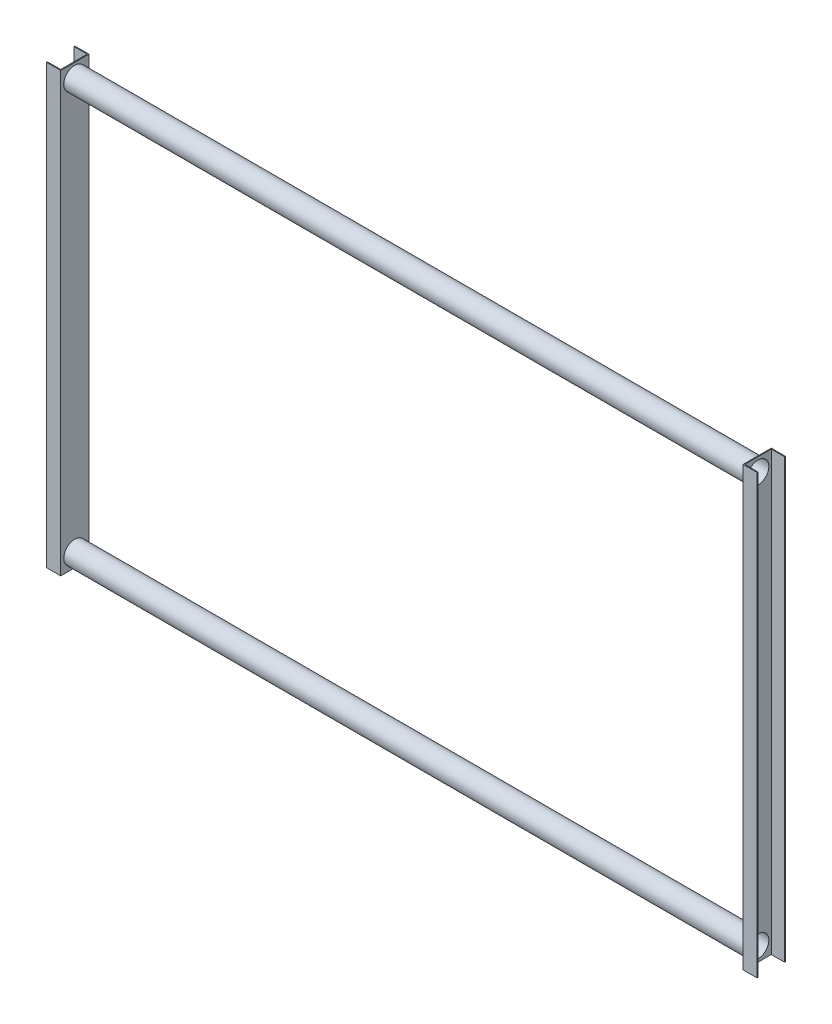
ISO-10303-21;
HEADER;
FILE_DESCRIPTION(('STEP AP214'),'2;1');
FILE_NAME('part.step','',(''),(''),'','','');
FILE_SCHEMA(('AUTOMOTIVE_DESIGN { 1 0 10303 214 1 1 1 1 }'));
ENDSEC;
DATA;
#1=APPLICATION_CONTEXT('core data for automotive mechanical design processes');
#2=APPLICATION_PROTOCOL_DEFINITION('international standard','automotive_design',2000,#1);
#3=PRODUCT_CONTEXT('',#1,'mechanical');
#4=PRODUCT('Part','Part','',(#3));
#5=PRODUCT_RELATED_PRODUCT_CATEGORY('part','',(#4));
#6=PRODUCT_DEFINITION_FORMATION('','',#4);
#7=PRODUCT_DEFINITION_CONTEXT('part definition',#1,'design');
#8=PRODUCT_DEFINITION('design','',#6,#7);
#9=PRODUCT_DEFINITION_SHAPE('','',#8);
#10=(LENGTH_UNIT() NAMED_UNIT(*) SI_UNIT(.MILLI.,.METRE.));
#11=(NAMED_UNIT(*) PLANE_ANGLE_UNIT() SI_UNIT($,.RADIAN.));
#12=(NAMED_UNIT(*) SI_UNIT($,.STERADIAN.) SOLID_ANGLE_UNIT());
#13=UNCERTAINTY_MEASURE_WITH_UNIT(LENGTH_MEASURE(1.E-05),#10,'distance_accuracy_value','');
#14=(GEOMETRIC_REPRESENTATION_CONTEXT(3) GLOBAL_UNCERTAINTY_ASSIGNED_CONTEXT((#13)) GLOBAL_UNIT_ASSIGNED_CONTEXT((#10,
#11,#12)) REPRESENTATION_CONTEXT('',''));
#15=CARTESIAN_POINT('',(0.,0.,0.));
#16=DIRECTION('',(0.,0.,1.));
#17=DIRECTION('',(1.,0.,0.));
#18=AXIS2_PLACEMENT_3D('',#15,#16,#17);
#19=CARTESIAN_POINT('',(0.,1600.,-51.5));
#20=DIRECTION('',(-1.,0.,0.));
#21=DIRECTION('',(0.,0.,1.));
#22=AXIS2_PLACEMENT_3D('',#19,#20,#21);
#23=PLANE('',#22);
#24=CARTESIAN_POINT('',(0.,50.,0.));
#25=DIRECTION('',(-1.,0.,0.));
#26=DIRECTION('',(0.,0.,1.));
#27=AXIS2_PLACEMENT_3D('',#24,#25,#26);
#28=CIRCLE('',#27,40.5);
#29=CARTESIAN_POINT('',(0.,50.,40.5));
#30=VERTEX_POINT('',#29);
#31=EDGE_CURVE('E191',#30,#30,#28,.F.);
#32=ORIENTED_EDGE('',*,*,#31,.F.);
#33=EDGE_LOOP('',(#32));
#34=FACE_BOUND('',#33,.T.);
#35=DIRECTION('',(0.,0.,-1.));
#36=VECTOR('',#35,1.);
#37=CARTESIAN_POINT('',(0.,0.,-51.5));
#38=LINE('',#37,#36);
#39=CARTESIAN_POINT('',(0.,0.,51.5));
#40=VERTEX_POINT('',#39);
#41=CARTESIAN_POINT('',(0.,0.,-51.5));
#42=VERTEX_POINT('',#41);
#43=EDGE_CURVE('E157',#40,#42,#38,.T.);
#44=ORIENTED_EDGE('',*,*,#43,.T.);
#45=DIRECTION('',(0.,-1.,0.));
#46=VECTOR('',#45,1.);
#47=CARTESIAN_POINT('',(0.,1600.,-51.5));
#48=LINE('',#47,#46);
#49=CARTESIAN_POINT('',(0.,1600.,-51.5));
#50=VERTEX_POINT('',#49);
#51=EDGE_CURVE('E176',#50,#42,#48,.T.);
#52=ORIENTED_EDGE('',*,*,#51,.F.);
#53=DIRECTION('',(0.,0.,-1.));
#54=VECTOR('',#53,1.);
#55=CARTESIAN_POINT('',(0.,1600.,-51.5));
#56=LINE('',#55,#54);
#57=CARTESIAN_POINT('',(0.,1600.,51.5));
#58=VERTEX_POINT('',#57);
#59=EDGE_CURVE('E284',#58,#50,#56,.T.);
#60=ORIENTED_EDGE('',*,*,#59,.F.);
#61=DIRECTION('',(0.,-1.,0.));
#62=VECTOR('',#61,1.);
#63=CARTESIAN_POINT('',(0.,1600.,51.5));
#64=LINE('',#63,#62);
#65=EDGE_CURVE('E180',#58,#40,#64,.T.);
#66=ORIENTED_EDGE('',*,*,#65,.T.);
#67=EDGE_LOOP('',(#44,#52,#60,#66));
#68=FACE_BOUND('',#67,.T.);
#69=CARTESIAN_POINT('',(0.,1550.,0.));
#70=DIRECTION('',(-1.,0.,0.));
#71=DIRECTION('',(0.,0.,1.));
#72=AXIS2_PLACEMENT_3D('',#69,#70,#71);
#73=CIRCLE('',#72,40.5);
#74=CARTESIAN_POINT('',(0.,1550.,40.5));
#75=VERTEX_POINT('',#74);
#76=EDGE_CURVE('E11',#75,#75,#73,.F.);
#77=ORIENTED_EDGE('',*,*,#76,.F.);
#78=EDGE_LOOP('',(#77));
#79=FACE_BOUND('',#78,.T.);
#80=ADVANCED_FACE('F39',(#34,#68,#79),#23,.F.);
#81=CARTESIAN_POINT('',(2494.,1600.,-51.5000000000003));
#82=DIRECTION('',(1.,0.,0.));
#83=DIRECTION('',(0.,0.,-1.));
#84=AXIS2_PLACEMENT_3D('',#81,#82,#83);
#85=PLANE('',#84);
#86=DIRECTION('',(0.,0.,1.));
#87=VECTOR('',#86,1.);
#88=CARTESIAN_POINT('',(2494.,0.,-51.5000000000003));
#89=LINE('',#88,#87);
#90=CARTESIAN_POINT('',(2494.,0.,-51.5000000000003));
#91=VERTEX_POINT('',#90);
#92=CARTESIAN_POINT('',(2494.,0.,51.4999999999988));
#93=VERTEX_POINT('',#92);
#94=EDGE_CURVE('E351',#91,#93,#89,.T.);
#95=ORIENTED_EDGE('',*,*,#94,.T.);
#96=DIRECTION('',(0.,-1.,0.));
#97=VECTOR('',#96,1.);
#98=CARTESIAN_POINT('',(2494.,1600.,51.4999999999988));
#99=LINE('',#98,#97);
#100=CARTESIAN_POINT('',(2494.,1600.,51.4999999999988));
#101=VERTEX_POINT('',#100);
#102=EDGE_CURVE('E321',#101,#93,#99,.T.);
#103=ORIENTED_EDGE('',*,*,#102,.F.);
#104=DIRECTION('',(0.,0.,1.));
#105=VECTOR('',#104,1.);
#106=CARTESIAN_POINT('',(2494.,1600.,-51.5000000000003));
#107=LINE('',#106,#105);
#108=CARTESIAN_POINT('',(2494.,1600.,-51.5000000000003));
#109=VERTEX_POINT('',#108);
#110=EDGE_CURVE('E382',#109,#101,#107,.T.);
#111=ORIENTED_EDGE('',*,*,#110,.F.);
#112=DIRECTION('',(0.,-1.,0.));
#113=VECTOR('',#112,1.);
#114=CARTESIAN_POINT('',(2494.,1600.,-51.5000000000003));
#115=LINE('',#114,#113);
#116=EDGE_CURVE('E317',#109,#91,#115,.T.);
#117=ORIENTED_EDGE('',*,*,#116,.T.);
#118=EDGE_LOOP('',(#95,#103,#111,#117));
#119=FACE_BOUND('',#118,.T.);
#120=CARTESIAN_POINT('',(2494.,50.,-7.63567279268375E-13));
#121=DIRECTION('',(1.,0.,0.));
#122=DIRECTION('',(0.,0.,-1.));
#123=AXIS2_PLACEMENT_3D('',#120,#121,#122);
#124=CIRCLE('',#123,40.5);
#125=CARTESIAN_POINT('',(2494.,50.,-40.5000000000008));
#126=VERTEX_POINT('',#125);
#127=EDGE_CURVE('E298',#126,#126,#124,.T.);
#128=ORIENTED_EDGE('',*,*,#127,.T.);
#129=EDGE_LOOP('',(#128));
#130=FACE_BOUND('',#129,.T.);
#131=CARTESIAN_POINT('',(2494.,1550.,-7.63567279268375E-13));
#132=DIRECTION('',(1.,0.,0.));
#133=DIRECTION('',(0.,0.,-1.));
#134=AXIS2_PLACEMENT_3D('',#131,#132,#133);
#135=CIRCLE('',#134,40.5);
#136=CARTESIAN_POINT('',(2494.,1550.,-40.5000000000007));
#137=VERTEX_POINT('',#136);
#138=EDGE_CURVE('E49',#137,#137,#135,.F.);
#139=ORIENTED_EDGE('',*,*,#138,.F.);
#140=EDGE_LOOP('',(#139));
#141=FACE_BOUND('',#140,.T.);
#142=ADVANCED_FACE('F200',(#119,#130,#141),#85,.F.);
#143=CARTESIAN_POINT('',(-51.5,1600.,48.5));
#144=DIRECTION('',(0.,0.,1.));
#145=DIRECTION('',(1.,0.,0.));
#146=AXIS2_PLACEMENT_3D('',#143,#144,#145);
#147=PLANE('',#146);
#148=DIRECTION('',(-1.,0.,0.));
#149=VECTOR('',#148,1.);
#150=CARTESIAN_POINT('',(-51.5,0.,48.5));
#151=LINE('',#150,#149);
#152=CARTESIAN_POINT('',(-2.99999999999999,0.,48.5));
#153=VERTEX_POINT('',#152);
#154=CARTESIAN_POINT('',(-51.5,0.,48.5));
#155=VERTEX_POINT('',#154);
#156=EDGE_CURVE('E146',#153,#155,#151,.T.);
#157=ORIENTED_EDGE('',*,*,#156,.T.);
#158=DIRECTION('',(0.,-1.,0.));
#159=VECTOR('',#158,1.);
#160=CARTESIAN_POINT('',(-51.5,1600.,48.5));
#161=LINE('',#160,#159);
#162=CARTESIAN_POINT('',(-51.5,1600.,48.5));
#163=VERTEX_POINT('',#162);
#164=EDGE_CURVE('E188',#163,#155,#161,.T.);
#165=ORIENTED_EDGE('',*,*,#164,.F.);
#166=DIRECTION('',(-1.,0.,0.));
#167=VECTOR('',#166,1.);
#168=CARTESIAN_POINT('',(-51.5,1600.,48.5));
#169=LINE('',#168,#167);
#170=CARTESIAN_POINT('',(-2.99999999999999,1600.,48.5));
#171=VERTEX_POINT('',#170);
#172=EDGE_CURVE('E169',#171,#163,#169,.T.);
#173=ORIENTED_EDGE('',*,*,#172,.F.);
#174=DIRECTION('',(0.,-1.,0.));
#175=VECTOR('',#174,1.);
#176=CARTESIAN_POINT('',(-2.99999999999999,1600.,48.5));
#177=LINE('',#176,#175);
#178=EDGE_CURVE('E142',#171,#153,#177,.T.);
#179=ORIENTED_EDGE('',*,*,#178,.T.);
#180=EDGE_LOOP('',(#157,#165,#173,#179));
#181=FACE_BOUND('',#180,.T.);
#182=ADVANCED_FACE('F41',(#181),#147,.F.);
#183=CARTESIAN_POINT('',(-51.5,1600.,51.5));
#184=DIRECTION('',(1.,0.,0.));
#185=DIRECTION('',(0.,0.,-1.));
#186=AXIS2_PLACEMENT_3D('',#183,#184,#185);
#187=PLANE('',#186);
#188=DIRECTION('',(0.,0.,1.));
#189=VECTOR('',#188,1.);
#190=CARTESIAN_POINT('',(-51.5,0.,51.5));
#191=LINE('',#190,#189);
#192=CARTESIAN_POINT('',(-51.5,0.,51.5));
#193=VERTEX_POINT('',#192);
#194=EDGE_CURVE('E150',#155,#193,#191,.T.);
#195=ORIENTED_EDGE('',*,*,#194,.T.);
#196=DIRECTION('',(0.,-1.,0.));
#197=VECTOR('',#196,1.);
#198=CARTESIAN_POINT('',(-51.5,1600.,51.5));
#199=LINE('',#198,#197);
#200=CARTESIAN_POINT('',(-51.5,1600.,51.5));
#201=VERTEX_POINT('',#200);
#202=EDGE_CURVE('E184',#201,#193,#199,.T.);
#203=ORIENTED_EDGE('',*,*,#202,.F.);
#204=DIRECTION('',(0.,0.,1.));
#205=VECTOR('',#204,1.);
#206=CARTESIAN_POINT('',(-51.5,1600.,51.5));
#207=LINE('',#206,#205);
#208=EDGE_CURVE('E102',#163,#201,#207,.T.);
#209=ORIENTED_EDGE('',*,*,#208,.F.);
#210=ORIENTED_EDGE('',*,*,#164,.T.);
#211=EDGE_LOOP('',(#195,#203,#209,#210));
#212=FACE_BOUND('',#211,.T.);
#213=ADVANCED_FACE('F209',(#212),#187,.F.);
#214=CARTESIAN_POINT('',(0.,1600.,51.5));
#215=DIRECTION('',(0.,0.,-1.));
#216=DIRECTION('',(-1.,0.,0.));
#217=AXIS2_PLACEMENT_3D('',#214,#215,#216);
#218=PLANE('',#217);
#219=DIRECTION('',(1.,0.,0.));
#220=VECTOR('',#219,1.);
#221=CARTESIAN_POINT('',(0.,0.,51.5));
#222=LINE('',#221,#220);
#223=EDGE_CURVE('E154',#193,#40,#222,.T.);
#224=ORIENTED_EDGE('',*,*,#223,.T.);
#225=ORIENTED_EDGE('',*,*,#65,.F.);
#226=DIRECTION('',(1.,0.,0.));
#227=VECTOR('',#226,1.);
#228=CARTESIAN_POINT('',(0.,1600.,51.5));
#229=LINE('',#228,#227);
#230=EDGE_CURVE('E276',#201,#58,#229,.T.);
#231=ORIENTED_EDGE('',*,*,#230,.F.);
#232=ORIENTED_EDGE('',*,*,#202,.T.);
#233=EDGE_LOOP('',(#224,#225,#231,#232));
#234=FACE_BOUND('',#233,.T.);
#235=ADVANCED_FACE('F263',(#234),#218,.F.);
#236=CARTESIAN_POINT('',(-51.5,1600.,-51.5));
#237=DIRECTION('',(0.,0.,1.));
#238=DIRECTION('',(1.,0.,0.));
#239=AXIS2_PLACEMENT_3D('',#236,#237,#238);
#240=PLANE('',#239);
#241=DIRECTION('',(-1.,0.,0.));
#242=VECTOR('',#241,1.);
#243=CARTESIAN_POINT('',(-51.5,0.,-51.5));
#244=LINE('',#243,#242);
#245=CARTESIAN_POINT('',(-51.5,0.,-51.5));
#246=VERTEX_POINT('',#245);
#247=EDGE_CURVE('E160',#42,#246,#244,.T.);
#248=ORIENTED_EDGE('',*,*,#247,.T.);
#249=DIRECTION('',(0.,-1.,0.));
#250=VECTOR('',#249,1.);
#251=CARTESIAN_POINT('',(-51.5,1600.,-51.5));
#252=LINE('',#251,#250);
#253=CARTESIAN_POINT('',(-51.5,1600.,-51.5));
#254=VERTEX_POINT('',#253);
#255=EDGE_CURVE('E135',#254,#246,#252,.T.);
#256=ORIENTED_EDGE('',*,*,#255,.F.);
#257=DIRECTION('',(-1.,0.,0.));
#258=VECTOR('',#257,1.);
#259=CARTESIAN_POINT('',(-51.5,1600.,-51.5));
#260=LINE('',#259,#258);
#261=EDGE_CURVE('E124',#50,#254,#260,.T.);
#262=ORIENTED_EDGE('',*,*,#261,.F.);
#263=ORIENTED_EDGE('',*,*,#51,.T.);
#264=EDGE_LOOP('',(#248,#256,#262,#263));
#265=FACE_BOUND('',#264,.T.);
#266=ADVANCED_FACE('F261',(#265),#240,.F.);
#267=CARTESIAN_POINT('',(-51.5,1600.,-48.5));
#268=DIRECTION('',(1.,0.,0.));
#269=DIRECTION('',(0.,0.,-1.));
#270=AXIS2_PLACEMENT_3D('',#267,#268,#269);
#271=PLANE('',#270);
#272=DIRECTION('',(0.,0.,1.));
#273=VECTOR('',#272,1.);
#274=CARTESIAN_POINT('',(-51.5,0.,-48.5));
#275=LINE('',#274,#273);
#276=CARTESIAN_POINT('',(-51.5,0.,-48.5));
#277=VERTEX_POINT('',#276);
#278=EDGE_CURVE('E133',#246,#277,#275,.T.);
#279=ORIENTED_EDGE('',*,*,#278,.T.);
#280=DIRECTION('',(0.,-1.,0.));
#281=VECTOR('',#280,1.);
#282=CARTESIAN_POINT('',(-51.5,1600.,-48.5));
#283=LINE('',#282,#281);
#284=CARTESIAN_POINT('',(-51.5,1600.,-48.5));
#285=VERTEX_POINT('',#284);
#286=EDGE_CURVE('E130',#285,#277,#283,.T.);
#287=ORIENTED_EDGE('',*,*,#286,.F.);
#288=DIRECTION('',(0.,0.,1.));
#289=VECTOR('',#288,1.);
#290=CARTESIAN_POINT('',(-51.5,1600.,-48.5));
#291=LINE('',#290,#289);
#292=EDGE_CURVE('E118',#254,#285,#291,.T.);
#293=ORIENTED_EDGE('',*,*,#292,.F.);
#294=ORIENTED_EDGE('',*,*,#255,.T.);
#295=EDGE_LOOP('',(#279,#287,#293,#294));
#296=FACE_BOUND('',#295,.T.);
#297=ADVANCED_FACE('F131',(#296),#271,.F.);
#298=CARTESIAN_POINT('',(-2.99999999999999,1600.,-48.5));
#299=DIRECTION('',(0.,0.,-1.));
#300=DIRECTION('',(-1.,0.,0.));
#301=AXIS2_PLACEMENT_3D('',#298,#299,#300);
#302=PLANE('',#301);
#303=DIRECTION('',(1.,0.,0.));
#304=VECTOR('',#303,1.);
#305=CARTESIAN_POINT('',(-2.99999999999999,0.,-48.5));
#306=LINE('',#305,#304);
#307=CARTESIAN_POINT('',(-2.99999999999999,0.,-48.5));
#308=VERTEX_POINT('',#307);
#309=EDGE_CURVE('E87',#277,#308,#306,.T.);
#310=ORIENTED_EDGE('',*,*,#309,.T.);
#311=DIRECTION('',(0.,-1.,0.));
#312=VECTOR('',#311,1.);
#313=CARTESIAN_POINT('',(-2.99999999999999,1600.,-48.5));
#314=LINE('',#313,#312);
#315=CARTESIAN_POINT('',(-2.99999999999999,1600.,-48.5));
#316=VERTEX_POINT('',#315);
#317=EDGE_CURVE('E136',#316,#308,#314,.T.);
#318=ORIENTED_EDGE('',*,*,#317,.F.);
#319=DIRECTION('',(1.,0.,0.));
#320=VECTOR('',#319,1.);
#321=CARTESIAN_POINT('',(-2.99999999999999,1600.,-48.5));
#322=LINE('',#321,#320);
#323=EDGE_CURVE('E122',#285,#316,#322,.T.);
#324=ORIENTED_EDGE('',*,*,#323,.F.);
#325=ORIENTED_EDGE('',*,*,#286,.T.);
#326=EDGE_LOOP('',(#310,#318,#324,#325));
#327=FACE_BOUND('',#326,.T.);
#328=ADVANCED_FACE('F138',(#327),#302,.F.);
#329=CARTESIAN_POINT('',(-2.99999999999999,1600.,48.5));
#330=DIRECTION('',(1.,0.,0.));
#331=DIRECTION('',(0.,0.,-1.));
#332=AXIS2_PLACEMENT_3D('',#329,#330,#331);
#333=PLANE('',#332);
#334=CARTESIAN_POINT('',(-2.99999999999999,50.,0.));
#335=DIRECTION('',(-1.,0.,0.));
#336=DIRECTION('',(0.,0.,1.));
#337=AXIS2_PLACEMENT_3D('',#334,#335,#336);
#338=CIRCLE('',#337,39.5);
#339=CARTESIAN_POINT('',(-2.99999999999999,50.,39.5));
#340=VERTEX_POINT('',#339);
#341=EDGE_CURVE('E151',#340,#340,#338,.T.);
#342=ORIENTED_EDGE('',*,*,#341,.F.);
#343=EDGE_LOOP('',(#342));
#344=FACE_BOUND('',#343,.T.);
#345=CARTESIAN_POINT('',(-2.99999999999999,1550.,0.));
#346=DIRECTION('',(-1.,0.,0.));
#347=DIRECTION('',(0.,0.,1.));
#348=AXIS2_PLACEMENT_3D('',#345,#346,#347);
#349=CIRCLE('',#348,39.5);
#350=CARTESIAN_POINT('',(-2.99999999999999,1550.,39.5));
#351=VERTEX_POINT('',#350);
#352=EDGE_CURVE('E294',#351,#351,#349,.T.);
#353=ORIENTED_EDGE('',*,*,#352,.F.);
#354=EDGE_LOOP('',(#353));
#355=FACE_BOUND('',#354,.T.);
#356=DIRECTION('',(0.,0.,1.));
#357=VECTOR('',#356,1.);
#358=CARTESIAN_POINT('',(-2.99999999999999,0.,48.5));
#359=LINE('',#358,#357);
#360=EDGE_CURVE('E93',#308,#153,#359,.T.);
#361=ORIENTED_EDGE('',*,*,#360,.T.);
#362=ORIENTED_EDGE('',*,*,#178,.F.);
#363=DIRECTION('',(0.,0.,1.));
#364=VECTOR('',#363,1.);
#365=CARTESIAN_POINT('',(-2.99999999999999,1600.,48.5));
#366=LINE('',#365,#364);
#367=EDGE_CURVE('E57',#316,#171,#366,.T.);
#368=ORIENTED_EDGE('',*,*,#367,.F.);
#369=ORIENTED_EDGE('',*,*,#317,.T.);
#370=EDGE_LOOP('',(#361,#362,#368,#369));
#371=FACE_BOUND('',#370,.T.);
#372=ADVANCED_FACE('F250',(#344,#355,#371),#333,.F.);
#373=CARTESIAN_POINT('',(0.,1600.,0.));
#374=DIRECTION('',(0.,1.,0.));
#375=DIRECTION('',(0.,0.,1.));
#376=AXIS2_PLACEMENT_3D('',#373,#374,#375);
#377=PLANE('',#376);
#378=ORIENTED_EDGE('',*,*,#172,.T.);
#379=ORIENTED_EDGE('',*,*,#208,.T.);
#380=ORIENTED_EDGE('',*,*,#230,.T.);
#381=ORIENTED_EDGE('',*,*,#59,.T.);
#382=ORIENTED_EDGE('',*,*,#261,.T.);
#383=ORIENTED_EDGE('',*,*,#292,.T.);
#384=ORIENTED_EDGE('',*,*,#323,.T.);
#385=ORIENTED_EDGE('',*,*,#367,.T.);
#386=EDGE_LOOP('',(#378,#379,#380,#381,#382,#383,#384,#385));
#387=FACE_BOUND('',#386,.T.);
#388=ADVANCED_FACE('F120',(#387),#377,.T.);
#389=CARTESIAN_POINT('',(0.,0.,0.));
#390=DIRECTION('',(0.,1.,0.));
#391=DIRECTION('',(0.,0.,1.));
#392=AXIS2_PLACEMENT_3D('',#389,#390,#391);
#393=PLANE('',#392);
#394=ORIENTED_EDGE('',*,*,#156,.F.);
#395=ORIENTED_EDGE('',*,*,#360,.F.);
#396=ORIENTED_EDGE('',*,*,#309,.F.);
#397=ORIENTED_EDGE('',*,*,#278,.F.);
#398=ORIENTED_EDGE('',*,*,#247,.F.);
#399=ORIENTED_EDGE('',*,*,#43,.F.);
#400=ORIENTED_EDGE('',*,*,#223,.F.);
#401=ORIENTED_EDGE('',*,*,#194,.F.);
#402=EDGE_LOOP('',(#394,#395,#396,#397,#398,#399,#400,#401));
#403=FACE_BOUND('',#402,.T.);
#404=ADVANCED_FACE('F246',(#403),#393,.F.);
#405=CARTESIAN_POINT('',(2545.5,1550.,0.));
#406=DIRECTION('',(-1.,0.,0.));
#407=DIRECTION('',(0.,0.,1.));
#408=AXIS2_PLACEMENT_3D('',#405,#406,#407);
#409=CYLINDRICAL_SURFACE('',#408,39.5);
#410=ORIENTED_EDGE('',*,*,#352,.T.);
#411=EDGE_LOOP('',(#410));
#412=FACE_BOUND('',#411,.T.);
#413=CARTESIAN_POINT('',(2497.,1550.,0.));
#414=DIRECTION('',(-1.,0.,0.));
#415=DIRECTION('',(0.,0.,1.));
#416=AXIS2_PLACEMENT_3D('',#413,#414,#415);
#417=CIRCLE('',#416,39.5);
#418=CARTESIAN_POINT('',(2497.,1550.,39.5));
#419=VERTEX_POINT('',#418);
#420=EDGE_CURVE('E404',#419,#419,#417,.T.);
#421=ORIENTED_EDGE('',*,*,#420,.F.);
#422=EDGE_LOOP('',(#421));
#423=FACE_BOUND('',#422,.T.);
#424=ADVANCED_FACE('F242',(#412,#423),#409,.F.);
#425=CARTESIAN_POINT('',(2545.5,50.,0.));
#426=DIRECTION('',(-1.,0.,0.));
#427=DIRECTION('',(0.,0.,1.));
#428=AXIS2_PLACEMENT_3D('',#425,#426,#427);
#429=CYLINDRICAL_SURFACE('',#428,39.5);
#430=ORIENTED_EDGE('',*,*,#341,.T.);
#431=EDGE_LOOP('',(#430));
#432=FACE_BOUND('',#431,.T.);
#433=CARTESIAN_POINT('',(2497.,50.,0.));
#434=DIRECTION('',(-1.,0.,0.));
#435=DIRECTION('',(0.,0.,1.));
#436=AXIS2_PLACEMENT_3D('',#433,#434,#435);
#437=CIRCLE('',#436,39.5);
#438=CARTESIAN_POINT('',(2497.,50.,39.5));
#439=VERTEX_POINT('',#438);
#440=EDGE_CURVE('E370',#439,#439,#437,.T.);
#441=ORIENTED_EDGE('',*,*,#440,.F.);
#442=EDGE_LOOP('',(#441));
#443=FACE_BOUND('',#442,.T.);
#444=ADVANCED_FACE('F238',(#432,#443),#429,.F.);
#445=CARTESIAN_POINT('',(2608.55129855222,50.,-7.98638499545912E-13));
#446=DIRECTION('',(-1.,0.,0.));
#447=DIRECTION('',(0.,0.,1.));
#448=AXIS2_PLACEMENT_3D('',#445,#446,#447);
#449=CYLINDRICAL_SURFACE('',#448,40.5);
#450=ORIENTED_EDGE('',*,*,#31,.T.);
#451=EDGE_LOOP('',(#450));
#452=FACE_BOUND('',#451,.T.);
#453=ORIENTED_EDGE('',*,*,#127,.F.);
#454=EDGE_LOOP('',(#453));
#455=FACE_BOUND('',#454,.T.);
#456=ADVANCED_FACE('F234',(#452,#455),#449,.T.);
#457=CARTESIAN_POINT('',(2497.,1600.,48.4999999999997));
#458=DIRECTION('',(-1.,0.,0.));
#459=DIRECTION('',(0.,0.,1.));
#460=AXIS2_PLACEMENT_3D('',#457,#458,#459);
#461=PLANE('',#460);
#462=ORIENTED_EDGE('',*,*,#440,.T.);
#463=EDGE_LOOP('',(#462));
#464=FACE_BOUND('',#463,.T.);
#465=ORIENTED_EDGE('',*,*,#420,.T.);
#466=EDGE_LOOP('',(#465));
#467=FACE_BOUND('',#466,.T.);
#468=DIRECTION('',(0.,0.,-1.));
#469=VECTOR('',#468,1.);
#470=CARTESIAN_POINT('',(2497.,0.,48.4999999999997));
#471=LINE('',#470,#469);
#472=CARTESIAN_POINT('',(2497.,0.,48.4999999999997));
#473=VERTEX_POINT('',#472);
#474=CARTESIAN_POINT('',(2497.,0.,-48.5000000000003));
#475=VERTEX_POINT('',#474);
#476=EDGE_CURVE('E366',#473,#475,#471,.T.);
#477=ORIENTED_EDGE('',*,*,#476,.T.);
#478=DIRECTION('',(0.,-1.,0.));
#479=VECTOR('',#478,1.);
#480=CARTESIAN_POINT('',(2497.,1600.,-48.5000000000003));
#481=LINE('',#480,#479);
#482=CARTESIAN_POINT('',(2497.,1600.,-48.5000000000003));
#483=VERTEX_POINT('',#482);
#484=EDGE_CURVE('E305',#483,#475,#481,.T.);
#485=ORIENTED_EDGE('',*,*,#484,.F.);
#486=DIRECTION('',(0.,0.,-1.));
#487=VECTOR('',#486,1.);
#488=CARTESIAN_POINT('',(2497.,1600.,48.4999999999997));
#489=LINE('',#488,#487);
#490=CARTESIAN_POINT('',(2497.,1600.,48.4999999999997));
#491=VERTEX_POINT('',#490);
#492=EDGE_CURVE('E342',#491,#483,#489,.T.);
#493=ORIENTED_EDGE('',*,*,#492,.F.);
#494=DIRECTION('',(0.,-1.,0.));
#495=VECTOR('',#494,1.);
#496=CARTESIAN_POINT('',(2497.,1600.,48.4999999999997));
#497=LINE('',#496,#495);
#498=EDGE_CURVE('E333',#491,#473,#497,.T.);
#499=ORIENTED_EDGE('',*,*,#498,.T.);
#500=EDGE_LOOP('',(#477,#485,#493,#499));
#501=FACE_BOUND('',#500,.T.);
#502=ADVANCED_FACE('F230',(#464,#467,#501),#461,.F.);
#503=CARTESIAN_POINT('',(2497.,1600.,-48.5000000000003));
#504=DIRECTION('',(0.,0.,-1.));
#505=DIRECTION('',(-1.,0.,0.));
#506=AXIS2_PLACEMENT_3D('',#503,#504,#505);
#507=PLANE('',#506);
#508=DIRECTION('',(1.,0.,0.));
#509=VECTOR('',#508,1.);
#510=CARTESIAN_POINT('',(2497.,0.,-48.5000000000003));
#511=LINE('',#510,#509);
#512=CARTESIAN_POINT('',(2545.5,0.,-48.5000000000003));
#513=VERTEX_POINT('',#512);
#514=EDGE_CURVE('E362',#475,#513,#511,.T.);
#515=ORIENTED_EDGE('',*,*,#514,.T.);
#516=DIRECTION('',(0.,-1.,0.));
#517=VECTOR('',#516,1.);
#518=CARTESIAN_POINT('',(2545.5,1600.,-48.5000000000003));
#519=LINE('',#518,#517);
#520=CARTESIAN_POINT('',(2545.5,1600.,-48.5000000000003));
#521=VERTEX_POINT('',#520);
#522=EDGE_CURVE('E309',#521,#513,#519,.T.);
#523=ORIENTED_EDGE('',*,*,#522,.F.);
#524=DIRECTION('',(1.,0.,0.));
#525=VECTOR('',#524,1.);
#526=CARTESIAN_POINT('',(2497.,1600.,-48.5000000000003));
#527=LINE('',#526,#525);
#528=EDGE_CURVE('E394',#483,#521,#527,.T.);
#529=ORIENTED_EDGE('',*,*,#528,.F.);
#530=ORIENTED_EDGE('',*,*,#484,.T.);
#531=EDGE_LOOP('',(#515,#523,#529,#530));
#532=FACE_BOUND('',#531,.T.);
#533=ADVANCED_FACE('F226',(#532),#507,.F.);
#534=CARTESIAN_POINT('',(2545.5,1600.,-48.5000000000003));
#535=DIRECTION('',(-1.,0.,0.));
#536=DIRECTION('',(0.,0.,1.));
#537=AXIS2_PLACEMENT_3D('',#534,#535,#536);
#538=PLANE('',#537);
#539=DIRECTION('',(0.,0.,-1.));
#540=VECTOR('',#539,1.);
#541=CARTESIAN_POINT('',(2545.5,0.,-48.5000000000003));
#542=LINE('',#541,#540);
#543=CARTESIAN_POINT('',(2545.5,0.,-51.5000000000003));
#544=VERTEX_POINT('',#543);
#545=EDGE_CURVE('E358',#513,#544,#542,.T.);
#546=ORIENTED_EDGE('',*,*,#545,.T.);
#547=DIRECTION('',(0.,-1.,0.));
#548=VECTOR('',#547,1.);
#549=CARTESIAN_POINT('',(2545.5,1600.,-51.5000000000003));
#550=LINE('',#549,#548);
#551=CARTESIAN_POINT('',(2545.5,1600.,-51.5000000000003));
#552=VERTEX_POINT('',#551);
#553=EDGE_CURVE('E313',#552,#544,#550,.T.);
#554=ORIENTED_EDGE('',*,*,#553,.F.);
#555=DIRECTION('',(0.,0.,-1.));
#556=VECTOR('',#555,1.);
#557=CARTESIAN_POINT('',(2545.5,1600.,-48.5000000000003));
#558=LINE('',#557,#556);
#559=EDGE_CURVE('E390',#521,#552,#558,.T.);
#560=ORIENTED_EDGE('',*,*,#559,.F.);
#561=ORIENTED_EDGE('',*,*,#522,.T.);
#562=EDGE_LOOP('',(#546,#554,#560,#561));
#563=FACE_BOUND('',#562,.T.);
#564=ADVANCED_FACE('F222',(#563),#538,.F.);
#565=CARTESIAN_POINT('',(2545.5,1600.,-51.5000000000003));
#566=DIRECTION('',(0.,0.,1.));
#567=DIRECTION('',(1.,0.,0.));
#568=AXIS2_PLACEMENT_3D('',#565,#566,#567);
#569=PLANE('',#568);
#570=DIRECTION('',(-1.,0.,0.));
#571=VECTOR('',#570,1.);
#572=CARTESIAN_POINT('',(2545.5,0.,-51.5000000000003));
#573=LINE('',#572,#571);
#574=EDGE_CURVE('E354',#544,#91,#573,.T.);
#575=ORIENTED_EDGE('',*,*,#574,.T.);
#576=ORIENTED_EDGE('',*,*,#116,.F.);
#577=DIRECTION('',(-1.,0.,0.));
#578=VECTOR('',#577,1.);
#579=CARTESIAN_POINT('',(2545.5,1600.,-51.5000000000003));
#580=LINE('',#579,#578);
#581=EDGE_CURVE('E386',#552,#109,#580,.T.);
#582=ORIENTED_EDGE('',*,*,#581,.F.);
#583=ORIENTED_EDGE('',*,*,#553,.T.);
#584=EDGE_LOOP('',(#575,#576,#582,#583));
#585=FACE_BOUND('',#584,.T.);
#586=ADVANCED_FACE('F219',(#585),#569,.F.);
#587=CARTESIAN_POINT('',(2494.,1600.,51.4999999999988));
#588=DIRECTION('',(0.,0.,-1.));
#589=DIRECTION('',(-1.,0.,0.));
#590=AXIS2_PLACEMENT_3D('',#587,#588,#589);
#591=PLANE('',#590);
#592=DIRECTION('',(1.,0.,0.));
#593=VECTOR('',#592,1.);
#594=CARTESIAN_POINT('',(2494.,0.,51.4999999999988));
#595=LINE('',#594,#593);
#596=CARTESIAN_POINT('',(2545.5,0.,51.4999999999997));
#597=VERTEX_POINT('',#596);
#598=EDGE_CURVE('E347',#93,#597,#595,.T.);
#599=ORIENTED_EDGE('',*,*,#598,.T.);
#600=DIRECTION('',(0.,-1.,0.));
#601=VECTOR('',#600,1.);
#602=CARTESIAN_POINT('',(2545.5,1600.,51.4999999999997));
#603=LINE('',#602,#601);
#604=CARTESIAN_POINT('',(2545.5,1600.,51.4999999999997));
#605=VERTEX_POINT('',#604);
#606=EDGE_CURVE('E325',#605,#597,#603,.T.);
#607=ORIENTED_EDGE('',*,*,#606,.F.);
#608=DIRECTION('',(1.,0.,0.));
#609=VECTOR('',#608,1.);
#610=CARTESIAN_POINT('',(2494.,1600.,51.4999999999988));
#611=LINE('',#610,#609);
#612=EDGE_CURVE('E378',#101,#605,#611,.T.);
#613=ORIENTED_EDGE('',*,*,#612,.F.);
#614=ORIENTED_EDGE('',*,*,#102,.T.);
#615=EDGE_LOOP('',(#599,#607,#613,#614));
#616=FACE_BOUND('',#615,.T.);
#617=ADVANCED_FACE('F217',(#616),#591,.F.);
#618=CARTESIAN_POINT('',(2545.5,1600.,51.4999999999997));
#619=DIRECTION('',(-1.,0.,0.));
#620=DIRECTION('',(0.,0.,1.));
#621=AXIS2_PLACEMENT_3D('',#618,#619,#620);
#622=PLANE('',#621);
#623=DIRECTION('',(0.,0.,-1.));
#624=VECTOR('',#623,1.);
#625=CARTESIAN_POINT('',(2545.5,0.,51.4999999999997));
#626=LINE('',#625,#624);
#627=CARTESIAN_POINT('',(2545.5,0.,48.4999999999997));
#628=VERTEX_POINT('',#627);
#629=EDGE_CURVE('E343',#597,#628,#626,.T.);
#630=ORIENTED_EDGE('',*,*,#629,.T.);
#631=DIRECTION('',(0.,-1.,0.));
#632=VECTOR('',#631,1.);
#633=CARTESIAN_POINT('',(2545.5,1600.,48.4999999999997));
#634=LINE('',#633,#632);
#635=CARTESIAN_POINT('',(2545.5,1600.,48.4999999999997));
#636=VERTEX_POINT('',#635);
#637=EDGE_CURVE('E329',#636,#628,#634,.T.);
#638=ORIENTED_EDGE('',*,*,#637,.F.);
#639=DIRECTION('',(0.,0.,-1.));
#640=VECTOR('',#639,1.);
#641=CARTESIAN_POINT('',(2545.5,1600.,51.4999999999997));
#642=LINE('',#641,#640);
#643=EDGE_CURVE('E374',#605,#636,#642,.T.);
#644=ORIENTED_EDGE('',*,*,#643,.F.);
#645=ORIENTED_EDGE('',*,*,#606,.T.);
#646=EDGE_LOOP('',(#630,#638,#644,#645));
#647=FACE_BOUND('',#646,.T.);
#648=ADVANCED_FACE('F469',(#647),#622,.F.);
#649=CARTESIAN_POINT('',(2545.5,1600.,48.4999999999997));
#650=DIRECTION('',(0.,0.,1.));
#651=DIRECTION('',(1.,0.,0.));
#652=AXIS2_PLACEMENT_3D('',#649,#650,#651);
#653=PLANE('',#652);
#654=DIRECTION('',(-1.,0.,0.));
#655=VECTOR('',#654,1.);
#656=CARTESIAN_POINT('',(2545.5,0.,48.4999999999997));
#657=LINE('',#656,#655);
#658=EDGE_CURVE('E338',#628,#473,#657,.T.);
#659=ORIENTED_EDGE('',*,*,#658,.T.);
#660=ORIENTED_EDGE('',*,*,#498,.F.);
#661=DIRECTION('',(-1.,0.,0.));
#662=VECTOR('',#661,1.);
#663=CARTESIAN_POINT('',(2545.5,1600.,48.4999999999997));
#664=LINE('',#663,#662);
#665=EDGE_CURVE('E337',#636,#491,#664,.T.);
#666=ORIENTED_EDGE('',*,*,#665,.F.);
#667=ORIENTED_EDGE('',*,*,#637,.T.);
#668=EDGE_LOOP('',(#659,#660,#666,#667));
#669=FACE_BOUND('',#668,.T.);
#670=ADVANCED_FACE('F471',(#669),#653,.F.);
#671=CARTESIAN_POINT('',(0.,1600.,0.));
#672=DIRECTION('',(0.,-1.,0.));
#673=DIRECTION('',(0.,0.,-1.));
#674=AXIS2_PLACEMENT_3D('',#671,#672,#673);
#675=PLANE('',#674);
#676=ORIENTED_EDGE('',*,*,#492,.T.);
#677=ORIENTED_EDGE('',*,*,#528,.T.);
#678=ORIENTED_EDGE('',*,*,#559,.T.);
#679=ORIENTED_EDGE('',*,*,#581,.T.);
#680=ORIENTED_EDGE('',*,*,#110,.T.);
#681=ORIENTED_EDGE('',*,*,#612,.T.);
#682=ORIENTED_EDGE('',*,*,#643,.T.);
#683=ORIENTED_EDGE('',*,*,#665,.T.);
#684=EDGE_LOOP('',(#676,#677,#678,#679,#680,#681,#682,#683));
#685=FACE_BOUND('',#684,.T.);
#686=ADVANCED_FACE('F455',(#685),#675,.F.);
#687=CARTESIAN_POINT('',(0.,0.,0.));
#688=DIRECTION('',(0.,-1.,0.));
#689=DIRECTION('',(0.,0.,-1.));
#690=AXIS2_PLACEMENT_3D('',#687,#688,#689);
#691=PLANE('',#690);
#692=ORIENTED_EDGE('',*,*,#476,.F.);
#693=ORIENTED_EDGE('',*,*,#658,.F.);
#694=ORIENTED_EDGE('',*,*,#629,.F.);
#695=ORIENTED_EDGE('',*,*,#598,.F.);
#696=ORIENTED_EDGE('',*,*,#94,.F.);
#697=ORIENTED_EDGE('',*,*,#574,.F.);
#698=ORIENTED_EDGE('',*,*,#545,.F.);
#699=ORIENTED_EDGE('',*,*,#514,.F.);
#700=EDGE_LOOP('',(#692,#693,#694,#695,#696,#697,#698,#699));
#701=FACE_BOUND('',#700,.T.);
#702=ADVANCED_FACE('F422',(#701),#691,.T.);
#703=CARTESIAN_POINT('',(2608.55129855222,1550.,-7.98638499545912E-13));
#704=DIRECTION('',(-1.,0.,0.));
#705=DIRECTION('',(0.,0.,1.));
#706=AXIS2_PLACEMENT_3D('',#703,#704,#705);
#707=CYLINDRICAL_SURFACE('',#706,40.5);
#708=ORIENTED_EDGE('',*,*,#76,.T.);
#709=EDGE_LOOP('',(#708));
#710=FACE_BOUND('',#709,.T.);
#711=ORIENTED_EDGE('',*,*,#138,.T.);
#712=EDGE_LOOP('',(#711));
#713=FACE_BOUND('',#712,.T.);
#714=ADVANCED_FACE('F198',(#710,#713),#707,.T.);
#715=CLOSED_SHELL('',(#80,#142,#182,#213,#235,#266,#297,#328,#372,#388,#404,#424,#444,#456,#502,
#533,#564,#586,#617,#648,#670,#686,#702,#714));
#716=MANIFOLD_SOLID_BREP('B2',#715);
#717=ADVANCED_BREP_SHAPE_REPRESENTATION('',(#18,#716),#14);
#718=SHAPE_DEFINITION_REPRESENTATION(#9,#717);
ENDSEC;
END-ISO-10303-21;
